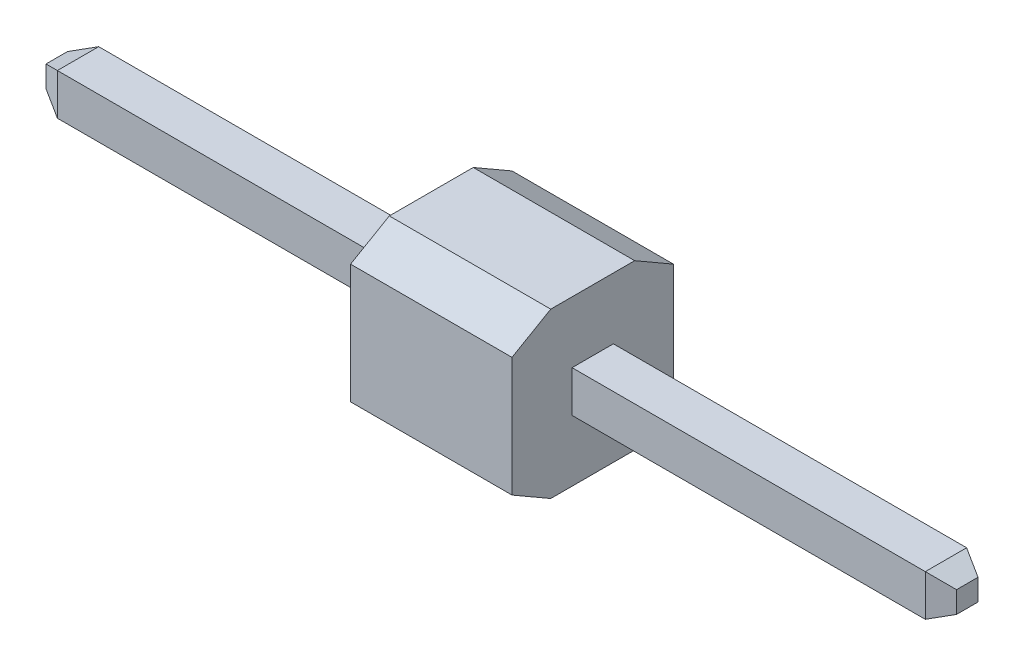
ISO-10303-21;
HEADER;
FILE_DESCRIPTION(('STEP AP214'),'2;1');
FILE_NAME('part.step','',(''),(''),'','','');
FILE_SCHEMA(('AUTOMOTIVE_DESIGN { 1 0 10303 214 1 1 1 1 }'));
ENDSEC;
DATA;
#1=APPLICATION_CONTEXT('core data for automotive mechanical design processes');
#2=APPLICATION_PROTOCOL_DEFINITION('international standard','automotive_design',2000,#1);
#3=PRODUCT_CONTEXT('',#1,'mechanical');
#4=PRODUCT('Part','Part','',(#3));
#5=PRODUCT_RELATED_PRODUCT_CATEGORY('part','',(#4));
#6=PRODUCT_DEFINITION_FORMATION('','',#4);
#7=PRODUCT_DEFINITION_CONTEXT('part definition',#1,'design');
#8=PRODUCT_DEFINITION('design','',#6,#7);
#9=PRODUCT_DEFINITION_SHAPE('','',#8);
#10=(LENGTH_UNIT() NAMED_UNIT(*) SI_UNIT(.MILLI.,.METRE.));
#11=(NAMED_UNIT(*) PLANE_ANGLE_UNIT() SI_UNIT($,.RADIAN.));
#12=(NAMED_UNIT(*) SI_UNIT($,.STERADIAN.) SOLID_ANGLE_UNIT());
#13=UNCERTAINTY_MEASURE_WITH_UNIT(LENGTH_MEASURE(1.E-05),#10,'distance_accuracy_value','');
#14=(GEOMETRIC_REPRESENTATION_CONTEXT(3) GLOBAL_UNCERTAINTY_ASSIGNED_CONTEXT((#13)) GLOBAL_UNIT_ASSIGNED_CONTEXT((#10,
#11,#12)) REPRESENTATION_CONTEXT('',''));
#15=CARTESIAN_POINT('',(0.,0.,0.));
#16=DIRECTION('',(0.,0.,1.));
#17=DIRECTION('',(1.,0.,0.));
#18=AXIS2_PLACEMENT_3D('',#15,#16,#17);
#19=CARTESIAN_POINT('',(5.42105211830969,13.017121448103,-2.62999936467802));
#20=DIRECTION('',(1.,-9.93476518829084E-08,4.37113882867379E-08));
#21=DIRECTION('',(-9.93476589883358E-08,-1.,8.74227765734759E-08));
#22=AXIS2_PLACEMENT_3D('',#19,#20,#21);
#23=PLANE('',#22);
#24=DIRECTION('',(-1.18186632779335E-08,-0.50000007571054,-0.866025360072934));
#25=VECTOR('',#24,1.);
#26=CARTESIAN_POINT('',(5.42105192613508,11.7735317468668,-1.05999925595995));
#27=LINE('',#26,#25);
#28=CARTESIAN_POINT('',(5.42105192613508,11.7735317468668,-1.05999925595995));
#29=VERTEX_POINT('',#28);
#30=CARTESIAN_POINT('',(5.42105191794687,11.4271215329031,-1.65999922567581));
#31=VERTEX_POINT('',#30);
#32=EDGE_CURVE('E11',#29,#31,#27,.T.);
#33=ORIENTED_EDGE('',*,*,#32,.T.);
#34=DIRECTION('',(4.37113811813104E-08,-8.74227842254741E-08,-0.999999999999995));
#35=VECTOR('',#34,1.);
#36=CARTESIAN_POINT('',(5.42105191794687,11.4271215329031,-1.65999922567581));
#37=LINE('',#36,#35);
#38=CARTESIAN_POINT('',(5.42105197477167,11.4271214192535,-2.95999922567581));
#39=VERTEX_POINT('',#38);
#40=EDGE_CURVE('E304',#31,#39,#37,.T.);
#41=ORIENTED_EDGE('',*,*,#40,.T.);
#42=DIRECTION('',(8.75289963531793E-08,0.499999924289839,-0.866025447495712));
#43=VECTOR('',#42,1.);
#44=CARTESIAN_POINT('',(5.42105197477167,11.4271214192535,-2.95999922567581));
#45=LINE('',#44,#43);
#46=CARTESIAN_POINT('',(5.42105203541353,11.7735315283098,-3.55999925595995));
#47=VERTEX_POINT('',#46);
#48=EDGE_CURVE('E296',#39,#47,#45,.T.);
#49=ORIENTED_EDGE('',*,*,#48,.T.);
#50=DIRECTION('',(9.93476588436478E-08,0.999999999999991,-8.74227764822788E-08));
#51=VECTOR('',#50,1.);
#52=CARTESIAN_POINT('',(5.42105203541353,11.7735315283098,-3.55999925595995));
#53=LINE('',#52,#51);
#54=CARTESIAN_POINT('',(5.42105221892651,13.6207112052799,-3.55999941744552));
#55=VERTEX_POINT('',#54);
#56=EDGE_CURVE('E281',#47,#55,#53,.T.);
#57=ORIENTED_EDGE('',*,*,#56,.T.);
#58=DIRECTION('',(-1.18186632778483E-08,-0.500000075710537,-0.866025360072935));
#59=VECTOR('',#58,1.);
#60=CARTESIAN_POINT('',(5.42105222711472,13.9671214192535,-2.95999944772966));
#61=LINE('',#60,#59);
#62=CARTESIAN_POINT('',(5.42105222711472,13.9671214192535,-2.95999944772966));
#63=VERTEX_POINT('',#62);
#64=EDGE_CURVE('E265',#63,#55,#61,.T.);
#65=ORIENTED_EDGE('',*,*,#64,.F.);
#66=DIRECTION('',(4.37113811813104E-08,-8.74227842254741E-08,-0.999999999999995));
#67=VECTOR('',#66,1.);
#68=CARTESIAN_POINT('',(5.42105217028992,13.9671215329031,-1.65999944772966));
#69=LINE('',#68,#67);
#70=CARTESIAN_POINT('',(5.42105217028992,13.9671215329031,-1.65999944772966));
#71=VERTEX_POINT('',#70);
#72=EDGE_CURVE('E248',#71,#63,#69,.T.);
#73=ORIENTED_EDGE('',*,*,#72,.F.);
#74=DIRECTION('',(8.75289963525477E-08,0.499999924289836,-0.866025447495714));
#75=VECTOR('',#74,1.);
#76=CARTESIAN_POINT('',(5.42105210964806,13.6207114238368,-1.05999941744552));
#77=LINE('',#76,#75);
#78=CARTESIAN_POINT('',(5.42105210964806,13.6207114238368,-1.05999941744552));
#79=VERTEX_POINT('',#78);
#80=EDGE_CURVE('E242',#79,#71,#77,.T.);
#81=ORIENTED_EDGE('',*,*,#80,.F.);
#82=DIRECTION('',(9.93476588436478E-08,0.999999999999991,-8.74227763620714E-08));
#83=VECTOR('',#82,1.);
#84=CARTESIAN_POINT('',(5.42105192613508,11.7735317468668,-1.05999925595995));
#85=LINE('',#84,#83);
#86=EDGE_CURVE('E236',#29,#79,#85,.T.);
#87=ORIENTED_EDGE('',*,*,#86,.F.);
#88=EDGE_LOOP('',(#33,#41,#49,#57,#65,#73,#81,#87));
#89=FACE_BOUND('',#88,.T.);
#90=DIRECTION('',(-4.37113803486431E-08,8.74227856773042E-08,0.999999999999995));
#91=VECTOR('',#90,1.);
#92=CARTESIAN_POINT('',(5.42105205472719,12.377121448103,-2.62999930872745));
#93=LINE('',#92,#91);
#94=CARTESIAN_POINT('',(5.42105205472719,12.377121448103,-2.62999930872745));
#95=VERTEX_POINT('',#94);
#96=CARTESIAN_POINT('',(5.4210520267519,12.3771215040536,-1.98999930872745));
#97=VERTEX_POINT('',#96);
#98=EDGE_CURVE('E302',#95,#97,#93,.T.);
#99=ORIENTED_EDGE('',*,*,#98,.T.);
#100=DIRECTION('',(-9.93476578781123E-08,-0.999999999999991,8.74227766567422E-08));
#101=VECTOR('',#100,1.);
#102=CARTESIAN_POINT('',(5.4210520903344,13.0171215040536,-1.98999936467802));
#103=LINE('',#102,#101);
#104=CARTESIAN_POINT('',(5.4210520903344,13.0171215040536,-1.98999936467802));
#105=VERTEX_POINT('',#104);
#106=EDGE_CURVE('E293',#105,#97,#103,.T.);
#107=ORIENTED_EDGE('',*,*,#106,.F.);
#108=DIRECTION('',(-4.37113817364219E-08,8.74227856773042E-08,0.999999999999995));
#109=VECTOR('',#108,1.);
#110=CARTESIAN_POINT('',(5.42105211830969,13.017121448103,-2.62999936467802));
#111=LINE('',#110,#109);
#112=CARTESIAN_POINT('',(5.42105211830969,13.017121448103,-2.62999936467802));
#113=VERTEX_POINT('',#112);
#114=EDGE_CURVE('E278',#113,#105,#111,.T.);
#115=ORIENTED_EDGE('',*,*,#114,.F.);
#116=DIRECTION('',(-9.93476592658911E-08,-0.999999999999991,8.74227766567422E-08));
#117=VECTOR('',#116,1.);
#118=CARTESIAN_POINT('',(5.42105211830969,13.017121448103,-2.62999936467802));
#119=LINE('',#118,#117);
#120=EDGE_CURVE('E263',#113,#95,#119,.T.);
#121=ORIENTED_EDGE('',*,*,#120,.T.);
#122=EDGE_LOOP('',(#99,#107,#115,#121));
#123=FACE_BOUND('',#122,.T.);
#124=ADVANCED_FACE('F17',(#89,#123),#23,.T.);
#125=CARTESIAN_POINT('',(2.92105211830969,13.0171216964722,-2.62999947395649));
#126=DIRECTION('',(1.,-9.93476518829084E-08,4.37113882867379E-08));
#127=DIRECTION('',(-9.93476589883358E-08,-1.,8.74227765734759E-08));
#128=AXIS2_PLACEMENT_3D('',#125,#126,#127);
#129=PLANE('',#128);
#130=DIRECTION('',(-1.1818662636946E-08,-0.50000007571054,-0.866025360072934));
#131=VECTOR('',#130,1.);
#132=CARTESIAN_POINT('',(2.92105192613508,11.7735319952359,-1.05999936523842));
#133=LINE('',#132,#131);
#134=CARTESIAN_POINT('',(2.92105192613508,11.7735319952359,-1.05999936523842));
#135=VERTEX_POINT('',#134);
#136=CARTESIAN_POINT('',(2.92105191794687,11.4271217812723,-1.65999933495428));
#137=VERTEX_POINT('',#136);
#138=EDGE_CURVE('E24',#135,#137,#133,.T.);
#139=ORIENTED_EDGE('',*,*,#138,.F.);
#140=DIRECTION('',(9.93476590840625E-08,0.999999999999991,-8.74227763620714E-08));
#141=VECTOR('',#140,1.);
#142=CARTESIAN_POINT('',(2.92105192613508,11.7735319952359,-1.05999936523842));
#143=LINE('',#142,#141);
#144=CARTESIAN_POINT('',(2.92105210964806,13.6207116722059,-1.05999952672399));
#145=VERTEX_POINT('',#144);
#146=EDGE_CURVE('E300',#135,#145,#143,.T.);
#147=ORIENTED_EDGE('',*,*,#146,.T.);
#148=DIRECTION('',(8.75289957115602E-08,0.499999924289836,-0.866025447495714));
#149=VECTOR('',#148,1.);
#150=CARTESIAN_POINT('',(2.92105210964806,13.6207116722059,-1.05999952672399));
#151=LINE('',#150,#149);
#152=CARTESIAN_POINT('',(2.92105217028992,13.9671217812723,-1.65999955700813));
#153=VERTEX_POINT('',#152);
#154=EDGE_CURVE('E286',#145,#153,#151,.T.);
#155=ORIENTED_EDGE('',*,*,#154,.T.);
#156=DIRECTION('',(4.37113811813104E-08,-8.74227842254741E-08,-0.999999999999995));
#157=VECTOR('',#156,1.);
#158=CARTESIAN_POINT('',(2.92105217028992,13.9671217812723,-1.65999955700813));
#159=LINE('',#158,#157);
#160=CARTESIAN_POINT('',(2.92105222711472,13.9671216676226,-2.95999955700813));
#161=VERTEX_POINT('',#160);
#162=EDGE_CURVE('E271',#153,#161,#159,.T.);
#163=ORIENTED_EDGE('',*,*,#162,.T.);
#164=DIRECTION('',(-1.18186626368607E-08,-0.500000075710537,-0.866025360072935));
#165=VECTOR('',#164,1.);
#166=CARTESIAN_POINT('',(2.92105222711472,13.9671216676226,-2.95999955700813));
#167=LINE('',#166,#165);
#168=CARTESIAN_POINT('',(2.92105221892651,13.620711453649,-3.55999952672399));
#169=VERTEX_POINT('',#168);
#170=EDGE_CURVE('E253',#161,#169,#167,.T.);
#171=ORIENTED_EDGE('',*,*,#170,.T.);
#172=DIRECTION('',(9.93476590840625E-08,0.999999999999991,-8.74227764822788E-08));
#173=VECTOR('',#172,1.);
#174=CARTESIAN_POINT('',(2.92105203541353,11.773531776679,-3.55999936523842));
#175=LINE('',#174,#173);
#176=CARTESIAN_POINT('',(2.92105203541353,11.773531776679,-3.55999936523842));
#177=VERTEX_POINT('',#176);
#178=EDGE_CURVE('E261',#177,#169,#175,.T.);
#179=ORIENTED_EDGE('',*,*,#178,.F.);
#180=DIRECTION('',(8.75289957121918E-08,0.499999924289839,-0.866025447495712));
#181=VECTOR('',#180,1.);
#182=CARTESIAN_POINT('',(2.92105197477167,11.4271216676226,-2.95999933495428));
#183=LINE('',#182,#181);
#184=CARTESIAN_POINT('',(2.92105197477167,11.4271216676226,-2.95999933495428));
#185=VERTEX_POINT('',#184);
#186=EDGE_CURVE('E276',#185,#177,#183,.T.);
#187=ORIENTED_EDGE('',*,*,#186,.F.);
#188=DIRECTION('',(4.37113811813104E-08,-8.74227842254741E-08,-0.999999999999995));
#189=VECTOR('',#188,1.);
#190=CARTESIAN_POINT('',(2.92105191794687,11.4271217812723,-1.65999933495428));
#191=LINE('',#190,#189);
#192=EDGE_CURVE('E291',#137,#185,#191,.T.);
#193=ORIENTED_EDGE('',*,*,#192,.F.);
#194=EDGE_LOOP('',(#139,#147,#155,#163,#171,#179,#187,#193));
#195=FACE_BOUND('',#194,.T.);
#196=DIRECTION('',(-9.93476592658911E-08,-0.999999999999991,8.74227766567422E-08));
#197=VECTOR('',#196,1.);
#198=CARTESIAN_POINT('',(2.9210520903344,13.0171217524228,-1.98999947395649));
#199=LINE('',#198,#197);
#200=CARTESIAN_POINT('',(2.9210520903344,13.0171217524228,-1.98999947395649));
#201=VERTEX_POINT('',#200);
#202=CARTESIAN_POINT('',(2.9210520267519,12.3771217524228,-1.98999941800592));
#203=VERTEX_POINT('',#202);
#204=EDGE_CURVE('E298',#201,#203,#199,.T.);
#205=ORIENTED_EDGE('',*,*,#204,.T.);
#206=DIRECTION('',(-4.37113810425325E-08,8.74227856773042E-08,0.999999999999995));
#207=VECTOR('',#206,1.);
#208=CARTESIAN_POINT('',(2.92105205472719,12.3771216964722,-2.62999941800592));
#209=LINE('',#208,#207);
#210=CARTESIAN_POINT('',(2.92105205472719,12.3771216964722,-2.62999941800592));
#211=VERTEX_POINT('',#210);
#212=EDGE_CURVE('E283',#211,#203,#209,.T.);
#213=ORIENTED_EDGE('',*,*,#212,.F.);
#214=DIRECTION('',(-9.93476592658911E-08,-0.999999999999991,8.74227766567422E-08));
#215=VECTOR('',#214,1.);
#216=CARTESIAN_POINT('',(2.92105211830969,13.0171216964722,-2.62999947395649));
#217=LINE('',#216,#215);
#218=CARTESIAN_POINT('',(2.92105211830969,13.0171216964722,-2.62999947395649));
#219=VERTEX_POINT('',#218);
#220=EDGE_CURVE('E268',#219,#211,#217,.T.);
#221=ORIENTED_EDGE('',*,*,#220,.F.);
#222=DIRECTION('',(-4.37113810425325E-08,8.74227856773042E-08,0.999999999999995));
#223=VECTOR('',#222,1.);
#224=CARTESIAN_POINT('',(2.92105211830969,13.0171216964722,-2.62999947395649));
#225=LINE('',#224,#223);
#226=EDGE_CURVE('E251',#219,#201,#225,.T.);
#227=ORIENTED_EDGE('',*,*,#226,.T.);
#228=EDGE_LOOP('',(#205,#213,#221,#227));
#229=FACE_BOUND('',#228,.T.);
#230=ADVANCED_FACE('F314',(#195,#229),#129,.F.);
#231=CARTESIAN_POINT('',(5.42105192613508,11.7735317468668,-1.05999925595995));
#232=DIRECTION('',(1.07893287081065E-07,0.866025360072937,-0.500000075710535));
#233=DIRECTION('',(1.18186629566715E-08,0.500000075710542,0.866025360072941));
#234=AXIS2_PLACEMENT_3D('',#231,#232,#233);
#235=PLANE('',#234);
#236=ORIENTED_EDGE('',*,*,#138,.T.);
#237=DIRECTION('',(-0.999999999999994,9.93476533039933E-08,-4.37113883755555E-08));
#238=VECTOR('',#237,1.);
#239=CARTESIAN_POINT('',(5.42105191794687,11.4271215329031,-1.65999922567581));
#240=LINE('',#239,#238);
#241=EDGE_CURVE('E288',#31,#137,#240,.T.);
#242=ORIENTED_EDGE('',*,*,#241,.F.);
#243=ORIENTED_EDGE('',*,*,#32,.F.);
#244=DIRECTION('',(-0.999999999999994,9.93476504618223E-08,-4.3711388109102E-08));
#245=VECTOR('',#244,1.);
#246=CARTESIAN_POINT('',(5.42105192613508,11.7735317468668,-1.05999925595995));
#247=LINE('',#246,#245);
#248=EDGE_CURVE('E256',#29,#135,#247,.T.);
#249=ORIENTED_EDGE('',*,*,#248,.T.);
#250=EDGE_LOOP('',(#236,#242,#243,#249));
#251=FACE_BOUND('',#250,.T.);
#252=ADVANCED_FACE('F306',(#251),#235,.F.);
#253=CARTESIAN_POINT('',(5.42105191794687,11.4271215329031,-1.65999922567581));
#254=DIRECTION('',(9.93476589883358E-08,1.,-8.74227765734759E-08));
#255=DIRECTION('',(1.,-9.93476518829084E-08,4.37113882867379E-08));
#256=AXIS2_PLACEMENT_3D('',#253,#254,#255);
#257=PLANE('',#256);
#258=ORIENTED_EDGE('',*,*,#192,.T.);
#259=DIRECTION('',(-0.999999999999994,9.93476533039933E-08,-4.37113884643734E-08));
#260=VECTOR('',#259,1.);
#261=CARTESIAN_POINT('',(5.42105197477167,11.4271214192535,-2.95999922567581));
#262=LINE('',#261,#260);
#263=EDGE_CURVE('E273',#39,#185,#262,.T.);
#264=ORIENTED_EDGE('',*,*,#263,.F.);
#265=ORIENTED_EDGE('',*,*,#40,.F.);
#266=ORIENTED_EDGE('',*,*,#241,.T.);
#267=EDGE_LOOP('',(#258,#264,#265,#266));
#268=FACE_BOUND('',#267,.T.);
#269=ADVANCED_FACE('F311',(#268),#257,.F.);
#270=CARTESIAN_POINT('',(5.42105197477167,11.4271214192535,-2.95999922567581));
#271=DIRECTION('',(6.41819058997377E-08,0.866025447495721,0.499999924289845));
#272=DIRECTION('',(-8.7528996031702E-08,-0.499999924289838,0.866025447495717));
#273=AXIS2_PLACEMENT_3D('',#270,#271,#272);
#274=PLANE('',#273);
#275=ORIENTED_EDGE('',*,*,#186,.T.);
#276=DIRECTION('',(-0.999999999999994,9.93476504618223E-08,-4.37113882867377E-08));
#277=VECTOR('',#276,1.);
#278=CARTESIAN_POINT('',(5.42105203541353,11.7735315283098,-3.55999925595995));
#279=LINE('',#278,#277);
#280=EDGE_CURVE('E258',#47,#177,#279,.T.);
#281=ORIENTED_EDGE('',*,*,#280,.F.);
#282=ORIENTED_EDGE('',*,*,#48,.F.);
#283=ORIENTED_EDGE('',*,*,#263,.T.);
#284=EDGE_LOOP('',(#275,#281,#282,#283));
#285=FACE_BOUND('',#284,.T.);
#286=ADVANCED_FACE('F319',(#285),#274,.F.);
#287=CARTESIAN_POINT('',(5.42105203541353,11.7735315283098,-3.55999925595995));
#288=DIRECTION('',(-4.37113811813106E-08,8.74227836789032E-08,1.));
#289=DIRECTION('',(-1.,9.93476518829084E-08,-4.37113882867379E-08));
#290=AXIS2_PLACEMENT_3D('',#287,#288,#289);
#291=PLANE('',#290);
#292=ORIENTED_EDGE('',*,*,#178,.T.);
#293=DIRECTION('',(-0.999999999999994,9.93476533039933E-08,-4.37113884643734E-08));
#294=VECTOR('',#293,1.);
#295=CARTESIAN_POINT('',(5.42105221892651,13.6207112052799,-3.55999941744552));
#296=LINE('',#295,#294);
#297=EDGE_CURVE('E245',#55,#169,#296,.T.);
#298=ORIENTED_EDGE('',*,*,#297,.F.);
#299=ORIENTED_EDGE('',*,*,#56,.F.);
#300=ORIENTED_EDGE('',*,*,#280,.T.);
#301=EDGE_LOOP('',(#292,#298,#299,#300));
#302=FACE_BOUND('',#301,.T.);
#303=ADVANCED_FACE('F326',(#302),#291,.F.);
#304=CARTESIAN_POINT('',(5.42105222711472,13.9671214192535,-2.95999944772966));
#305=DIRECTION('',(1.07893287081065E-07,0.866025360072937,-0.500000075710535));
#306=DIRECTION('',(1.18186629566715E-08,0.500000075710542,0.866025360072941));
#307=AXIS2_PLACEMENT_3D('',#304,#305,#306);
#308=PLANE('',#307);
#309=ORIENTED_EDGE('',*,*,#170,.F.);
#310=DIRECTION('',(-0.999999999999994,9.93476490407369E-08,-4.37113882867377E-08));
#311=VECTOR('',#310,1.);
#312=CARTESIAN_POINT('',(5.42105222711472,13.9671214192535,-2.95999944772966));
#313=LINE('',#312,#311);
#314=EDGE_CURVE('E239',#63,#161,#313,.T.);
#315=ORIENTED_EDGE('',*,*,#314,.F.);
#316=ORIENTED_EDGE('',*,*,#64,.T.);
#317=ORIENTED_EDGE('',*,*,#297,.T.);
#318=EDGE_LOOP('',(#309,#315,#316,#317));
#319=FACE_BOUND('',#318,.T.);
#320=ADVANCED_FACE('F329',(#319),#308,.T.);
#321=CARTESIAN_POINT('',(5.42105217028992,13.9671215329031,-1.65999944772966));
#322=DIRECTION('',(9.93476589883358E-08,1.,-8.74227765734759E-08));
#323=DIRECTION('',(1.,-9.93476518829084E-08,4.37113882867379E-08));
#324=AXIS2_PLACEMENT_3D('',#321,#322,#323);
#325=PLANE('',#324);
#326=ORIENTED_EDGE('',*,*,#162,.F.);
#327=DIRECTION('',(-0.999999999999994,9.93476490407369E-08,-4.37113882867377E-08));
#328=VECTOR('',#327,1.);
#329=CARTESIAN_POINT('',(5.42105217028992,13.9671215329031,-1.65999944772966));
#330=LINE('',#329,#328);
#331=EDGE_CURVE('E233',#71,#153,#330,.T.);
#332=ORIENTED_EDGE('',*,*,#331,.F.);
#333=ORIENTED_EDGE('',*,*,#72,.T.);
#334=ORIENTED_EDGE('',*,*,#314,.T.);
#335=EDGE_LOOP('',(#326,#332,#333,#334));
#336=FACE_BOUND('',#335,.T.);
#337=ADVANCED_FACE('F333',(#336),#325,.T.);
#338=CARTESIAN_POINT('',(5.42105210964806,13.6207114238368,-1.05999941744552));
#339=DIRECTION('',(6.41819058997377E-08,0.866025447495721,0.499999924289845));
#340=DIRECTION('',(-8.7528996031702E-08,-0.499999924289838,0.866025447495717));
#341=AXIS2_PLACEMENT_3D('',#338,#339,#340);
#342=PLANE('',#341);
#343=ORIENTED_EDGE('',*,*,#154,.F.);
#344=DIRECTION('',(-0.999999999999994,9.93476533039933E-08,-4.3711388109102E-08));
#345=VECTOR('',#344,1.);
#346=CARTESIAN_POINT('',(5.42105210964806,13.6207114238368,-1.05999941744552));
#347=LINE('',#346,#345);
#348=EDGE_CURVE('E230',#79,#145,#347,.T.);
#349=ORIENTED_EDGE('',*,*,#348,.F.);
#350=ORIENTED_EDGE('',*,*,#80,.T.);
#351=ORIENTED_EDGE('',*,*,#331,.T.);
#352=EDGE_LOOP('',(#343,#349,#350,#351));
#353=FACE_BOUND('',#352,.T.);
#354=ADVANCED_FACE('F337',(#353),#342,.T.);
#355=CARTESIAN_POINT('',(5.42105192613508,11.7735317468668,-1.05999925595995));
#356=DIRECTION('',(-4.37113811813106E-08,8.74227835615132E-08,1.));
#357=DIRECTION('',(-9.93476589883358E-08,-1.,8.74227764560859E-08));
#358=AXIS2_PLACEMENT_3D('',#355,#356,#357);
#359=PLANE('',#358);
#360=ORIENTED_EDGE('',*,*,#146,.F.);
#361=ORIENTED_EDGE('',*,*,#248,.F.);
#362=ORIENTED_EDGE('',*,*,#86,.T.);
#363=ORIENTED_EDGE('',*,*,#348,.T.);
#364=EDGE_LOOP('',(#360,#361,#362,#363));
#365=FACE_BOUND('',#364,.T.);
#366=ADVANCED_FACE('F339',(#365),#359,.T.);
#367=CARTESIAN_POINT('',(-2.87894788169031,13.0171222726885,-2.62999972748255));
#368=DIRECTION('',(-1.,9.93476518829084E-08,-4.37113882867379E-08));
#369=DIRECTION('',(9.93476589883358E-08,1.,-8.74227765734759E-08));
#370=AXIS2_PLACEMENT_3D('',#367,#368,#369);
#371=PLANE('',#370);
#372=DIRECTION('',(9.93476608211201E-08,0.999999999999991,-8.7422776141512E-08));
#373=VECTOR('',#372,1.);
#374=CARTESIAN_POINT('',(-2.87894795123395,12.5310038423764,-2.14388121217572));
#375=LINE('',#374,#373);
#376=CARTESIAN_POINT('',(-2.87894795123395,12.5310038423764,-2.14388121217572));
#377=VERTEX_POINT('',#376);
#378=CARTESIAN_POINT('',(-2.87894791822699,12.8632407879864,-2.1438812412208));
#379=VERTEX_POINT('',#378);
#380=EDGE_CURVE('E228',#377,#379,#375,.T.);
#381=ORIENTED_EDGE('',*,*,#380,.T.);
#382=DIRECTION('',(4.37113820547149E-08,-8.74227748027428E-08,-0.999999999999995));
#383=VECTOR('',#382,1.);
#384=CARTESIAN_POINT('',(-2.87894791822699,12.8632407879864,-2.1438812412208));
#385=LINE('',#384,#383);
#386=CARTESIAN_POINT('',(-2.87894790370445,12.8632407589413,-2.4761181868388));
#387=VERTEX_POINT('',#386);
#388=EDGE_CURVE('E223',#379,#387,#385,.T.);
#389=ORIENTED_EDGE('',*,*,#388,.T.);
#390=DIRECTION('',(-9.93476581477919E-08,-0.999999999999991,8.74227774781761E-08));
#391=VECTOR('',#390,1.);
#392=CARTESIAN_POINT('',(-2.87894790370446,12.8632407589413,-2.4761181868388));
#393=LINE('',#392,#391);
#394=CARTESIAN_POINT('',(-2.87894793671142,12.5310038133313,-2.47611815779372));
#395=VERTEX_POINT('',#394);
#396=EDGE_CURVE('E215',#387,#395,#393,.T.);
#397=ORIENTED_EDGE('',*,*,#396,.T.);
#398=DIRECTION('',(-4.37113740347301E-08,8.7422774802743E-08,0.999999999999995));
#399=VECTOR('',#398,1.);
#400=CARTESIAN_POINT('',(-2.87894793671142,12.5310038133313,-2.47611815779372));
#401=LINE('',#400,#399);
#402=EDGE_CURVE('E207',#395,#377,#401,.T.);
#403=ORIENTED_EDGE('',*,*,#402,.T.);
#404=EDGE_LOOP('',(#381,#389,#397,#403));
#405=FACE_BOUND('',#404,.T.);
#406=ADVANCED_FACE('F341',(#405),#371,.T.);
#407=CARTESIAN_POINT('',(-2.87894788169031,13.0171222726885,-2.62999972748255));
#408=DIRECTION('',(9.93476589883358E-08,1.,-8.74227764510112E-08));
#409=DIRECTION('',(-4.37113811813106E-08,8.74227835564385E-08,1.));
#410=AXIS2_PLACEMENT_3D('',#407,#408,#409);
#411=PLANE('',#410);
#412=DIRECTION('',(0.999999999999994,-9.93476508047534E-08,4.37113882769953E-08));
#413=VECTOR('',#412,1.);
#414=CARTESIAN_POINT('',(-2.54894788169031,13.0171222399038,-2.62999971305779));
#415=LINE('',#414,#413);
#416=CARTESIAN_POINT('',(-2.54894788169031,13.0171222399038,-2.62999971305779));
#417=VERTEX_POINT('',#416);
#418=EDGE_CURVE('E225',#417,#219,#415,.T.);
#419=ORIENTED_EDGE('',*,*,#418,.F.);
#420=DIRECTION('',(-4.37113817364219E-08,8.74227856773042E-08,0.999999999999995));
#421=VECTOR('',#420,1.);
#422=CARTESIAN_POINT('',(-2.54894788169031,13.0171222399038,-2.62999971305779));
#423=LINE('',#422,#421);
#424=CARTESIAN_POINT('',(-2.5489479096656,13.0171222958544,-1.98999971305779));
#425=VERTEX_POINT('',#424);
#426=EDGE_CURVE('E217',#417,#425,#423,.T.);
#427=ORIENTED_EDGE('',*,*,#426,.T.);
#428=DIRECTION('',(0.999999999999994,-9.93476508047534E-08,4.3711388195809E-08));
#429=VECTOR('',#428,1.);
#430=CARTESIAN_POINT('',(-2.5489479096656,13.0171222958544,-1.98999971305779));
#431=LINE('',#430,#429);
#432=EDGE_CURVE('E220',#425,#201,#431,.T.);
#433=ORIENTED_EDGE('',*,*,#432,.T.);
#434=ORIENTED_EDGE('',*,*,#226,.F.);
#435=EDGE_LOOP('',(#419,#427,#433,#434));
#436=FACE_BOUND('',#435,.T.);
#437=ADVANCED_FACE('F348',(#436),#411,.T.);
#438=CARTESIAN_POINT('',(-2.8789479096656,13.0171223286391,-1.98999972748255));
#439=DIRECTION('',(-4.37113811813106E-08,8.74227836789032E-08,1.));
#440=DIRECTION('',(-1.,9.93476518829084E-08,-4.37113882867379E-08));
#441=AXIS2_PLACEMENT_3D('',#438,#439,#440);
#442=PLANE('',#441);
#443=ORIENTED_EDGE('',*,*,#432,.F.);
#444=DIRECTION('',(-9.93476578781123E-08,-0.999999999999991,8.74227766567422E-08));
#445=VECTOR('',#444,1.);
#446=CARTESIAN_POINT('',(-2.5489479096656,13.0171222958544,-1.98999971305779));
#447=LINE('',#446,#445);
#448=CARTESIAN_POINT('',(-2.5489479732481,12.3771222958544,-1.98999965710721));
#449=VERTEX_POINT('',#448);
#450=EDGE_CURVE('E209',#425,#449,#447,.T.);
#451=ORIENTED_EDGE('',*,*,#450,.T.);
#452=DIRECTION('',(0.999999999999994,-9.93476508047534E-08,4.3711388195809E-08));
#453=VECTOR('',#452,1.);
#454=CARTESIAN_POINT('',(-2.5489479732481,12.3771222958544,-1.98999965710721));
#455=LINE('',#454,#453);
#456=EDGE_CURVE('E212',#449,#203,#455,.T.);
#457=ORIENTED_EDGE('',*,*,#456,.T.);
#458=ORIENTED_EDGE('',*,*,#204,.F.);
#459=EDGE_LOOP('',(#443,#451,#457,#458));
#460=FACE_BOUND('',#459,.T.);
#461=ADVANCED_FACE('F424',(#460),#442,.T.);
#462=CARTESIAN_POINT('',(-2.87894794527281,12.3771222726885,-2.62999967153197));
#463=DIRECTION('',(9.93476589883357E-08,1.,-8.74227764040693E-08));
#464=DIRECTION('',(-4.37113811813106E-08,8.74227835094966E-08,1.));
#465=AXIS2_PLACEMENT_3D('',#462,#463,#464);
#466=PLANE('',#465);
#467=ORIENTED_EDGE('',*,*,#456,.F.);
#468=DIRECTION('',(4.37113817364219E-08,-8.74227912284193E-08,-0.999999999999995));
#469=VECTOR('',#468,1.);
#470=CARTESIAN_POINT('',(-2.5489479732481,12.3771222958544,-1.98999965710721));
#471=LINE('',#470,#469);
#472=CARTESIAN_POINT('',(-2.54894794527281,12.3771222399038,-2.62999965710721));
#473=VERTEX_POINT('',#472);
#474=EDGE_CURVE('E201',#449,#473,#471,.T.);
#475=ORIENTED_EDGE('',*,*,#474,.T.);
#476=DIRECTION('',(0.999999999999994,-9.93476508047534E-08,4.37113882769953E-08));
#477=VECTOR('',#476,1.);
#478=CARTESIAN_POINT('',(-2.54894794527281,12.3771222399038,-2.62999965710721));
#479=LINE('',#478,#477);
#480=EDGE_CURVE('E204',#473,#211,#479,.T.);
#481=ORIENTED_EDGE('',*,*,#480,.T.);
#482=ORIENTED_EDGE('',*,*,#212,.T.);
#483=EDGE_LOOP('',(#467,#475,#481,#482));
#484=FACE_BOUND('',#483,.T.);
#485=ADVANCED_FACE('F421',(#484),#466,.F.);
#486=CARTESIAN_POINT('',(-2.87894788169031,13.0171222726885,-2.62999972748255));
#487=DIRECTION('',(-4.37113811813106E-08,8.74227836789032E-08,1.));
#488=DIRECTION('',(-1.,9.93476518829084E-08,-4.37113882867379E-08));
#489=AXIS2_PLACEMENT_3D('',#486,#487,#488);
#490=PLANE('',#489);
#491=ORIENTED_EDGE('',*,*,#480,.F.);
#492=DIRECTION('',(9.93476578781123E-08,0.999999999999991,-8.74227766567422E-08));
#493=VECTOR('',#492,1.);
#494=CARTESIAN_POINT('',(-2.54894794527281,12.3771222399038,-2.62999965710721));
#495=LINE('',#494,#493);
#496=EDGE_CURVE('E196',#473,#417,#495,.T.);
#497=ORIENTED_EDGE('',*,*,#496,.T.);
#498=ORIENTED_EDGE('',*,*,#418,.T.);
#499=ORIENTED_EDGE('',*,*,#220,.T.);
#500=EDGE_LOOP('',(#491,#497,#498,#499));
#501=FACE_BOUND('',#500,.T.);
#502=ADVANCED_FACE('F376',(#501),#490,.F.);
#503=CARTESIAN_POINT('',(-2.87894788169031,13.0171222726885,-2.62999972748255));
#504=DIRECTION('',(-4.37113811813106E-08,8.74227836789032E-08,1.));
#505=DIRECTION('',(-1.,9.93476518829084E-08,-4.37113882867379E-08));
#506=AXIS2_PLACEMENT_3D('',#503,#504,#505);
#507=PLANE('',#506);
#508=DIRECTION('',(0.999999999999994,-9.93476417118848E-08,4.37113882769953E-08));
#509=VECTOR('',#508,1.);
#510=CARTESIAN_POINT('',(5.42105211830969,13.017121448103,-2.62999936467802));
#511=LINE('',#510,#509);
#512=CARTESIAN_POINT('',(10.8910521183097,13.0171209046714,-2.62999912557673));
#513=VERTEX_POINT('',#512);
#514=EDGE_CURVE('E199',#113,#513,#511,.T.);
#515=ORIENTED_EDGE('',*,*,#514,.T.);
#516=DIRECTION('',(-9.93476578781123E-08,-0.999999999999991,8.74227766567422E-08));
#517=VECTOR('',#516,1.);
#518=CARTESIAN_POINT('',(10.8910521183097,13.0171209046714,-2.62999912557673));
#519=LINE('',#518,#517);
#520=CARTESIAN_POINT('',(10.8910520547272,12.3771209046714,-2.62999906962615));
#521=VERTEX_POINT('',#520);
#522=EDGE_CURVE('E191',#513,#521,#519,.T.);
#523=ORIENTED_EDGE('',*,*,#522,.T.);
#524=DIRECTION('',(0.999999999999994,-9.93476572996596E-08,4.37113882769953E-08));
#525=VECTOR('',#524,1.);
#526=CARTESIAN_POINT('',(5.42105205472719,12.3771214481031,-2.62999930872745));
#527=LINE('',#526,#525);
#528=EDGE_CURVE('E194',#95,#521,#527,.T.);
#529=ORIENTED_EDGE('',*,*,#528,.F.);
#530=ORIENTED_EDGE('',*,*,#120,.F.);
#531=EDGE_LOOP('',(#515,#523,#529,#530));
#532=FACE_BOUND('',#531,.T.);
#533=ADVANCED_FACE('F367',(#532),#507,.F.);
#534=CARTESIAN_POINT('',(-2.87894794527281,12.3771222726885,-2.62999967153197));
#535=DIRECTION('',(9.93476589883357E-08,1.,-8.74227764040693E-08));
#536=DIRECTION('',(-4.37113811813106E-08,8.74227835094966E-08,1.));
#537=AXIS2_PLACEMENT_3D('',#534,#535,#536);
#538=PLANE('',#537);
#539=ORIENTED_EDGE('',*,*,#528,.T.);
#540=DIRECTION('',(-4.37113817364219E-08,8.74227856773042E-08,0.999999999999995));
#541=VECTOR('',#540,1.);
#542=CARTESIAN_POINT('',(10.8910520547272,12.3771209046714,-2.62999906962615));
#543=LINE('',#542,#541);
#544=CARTESIAN_POINT('',(10.8910520267519,12.377120960622,-1.98999906962615));
#545=VERTEX_POINT('',#544);
#546=EDGE_CURVE('E186',#521,#545,#543,.T.);
#547=ORIENTED_EDGE('',*,*,#546,.T.);
#548=DIRECTION('',(0.999999999999994,-9.93476572996596E-08,4.37113881146227E-08));
#549=VECTOR('',#548,1.);
#550=CARTESIAN_POINT('',(5.4210520267519,12.3771215040536,-1.98999930872745));
#551=LINE('',#550,#549);
#552=EDGE_CURVE('E189',#97,#545,#551,.T.);
#553=ORIENTED_EDGE('',*,*,#552,.F.);
#554=ORIENTED_EDGE('',*,*,#98,.F.);
#555=EDGE_LOOP('',(#539,#547,#553,#554));
#556=FACE_BOUND('',#555,.T.);
#557=ADVANCED_FACE('F364',(#556),#538,.F.);
#558=CARTESIAN_POINT('',(-2.8789479096656,13.0171223286391,-1.98999972748255));
#559=DIRECTION('',(-4.37113811813106E-08,8.74227836789032E-08,1.));
#560=DIRECTION('',(-1.,9.93476518829084E-08,-4.37113882867379E-08));
#561=AXIS2_PLACEMENT_3D('',#558,#559,#560);
#562=PLANE('',#561);
#563=ORIENTED_EDGE('',*,*,#552,.T.);
#564=DIRECTION('',(9.93476606536699E-08,0.999999999999991,-8.74227766567422E-08));
#565=VECTOR('',#564,1.);
#566=CARTESIAN_POINT('',(10.8910520267519,12.377120960622,-1.98999906962615));
#567=LINE('',#566,#565);
#568=CARTESIAN_POINT('',(10.8910520903344,13.017120960622,-1.98999912557673));
#569=VERTEX_POINT('',#568);
#570=EDGE_CURVE('E176',#545,#569,#567,.T.);
#571=ORIENTED_EDGE('',*,*,#570,.T.);
#572=DIRECTION('',(0.999999999999994,-9.93476417118848E-08,4.37113881146227E-08));
#573=VECTOR('',#572,1.);
#574=CARTESIAN_POINT('',(5.4210520903344,13.0171215040536,-1.98999936467802));
#575=LINE('',#574,#573);
#576=EDGE_CURVE('E179',#105,#569,#575,.T.);
#577=ORIENTED_EDGE('',*,*,#576,.F.);
#578=ORIENTED_EDGE('',*,*,#106,.T.);
#579=EDGE_LOOP('',(#563,#571,#577,#578));
#580=FACE_BOUND('',#579,.T.);
#581=ADVANCED_FACE('F366',(#580),#562,.T.);
#582=CARTESIAN_POINT('',(-2.87894788169031,13.0171222726885,-2.62999972748255));
#583=DIRECTION('',(9.93476589883358E-08,1.,-8.74227764510112E-08));
#584=DIRECTION('',(-4.37113811813106E-08,8.74227835564385E-08,1.));
#585=AXIS2_PLACEMENT_3D('',#582,#583,#584);
#586=PLANE('',#585);
#587=ORIENTED_EDGE('',*,*,#576,.T.);
#588=DIRECTION('',(4.37113789608643E-08,-8.74227856773042E-08,-0.999999999999995));
#589=VECTOR('',#588,1.);
#590=CARTESIAN_POINT('',(10.8910520903344,13.017120960622,-1.98999912557673));
#591=LINE('',#590,#589);
#592=EDGE_CURVE('E167',#569,#513,#591,.T.);
#593=ORIENTED_EDGE('',*,*,#592,.T.);
#594=ORIENTED_EDGE('',*,*,#514,.F.);
#595=ORIENTED_EDGE('',*,*,#114,.T.);
#596=EDGE_LOOP('',(#587,#593,#594,#595));
#597=FACE_BOUND('',#596,.T.);
#598=ADVANCED_FACE('F373',(#597),#586,.T.);
#599=CARTESIAN_POINT('',(11.2210521183097,13.0171208718867,-2.62999911115197));
#600=DIRECTION('',(-1.,9.93476518829084E-08,-4.37113882867379E-08));
#601=DIRECTION('',(9.93476589883358E-08,1.,-8.74227765734759E-08));
#602=AXIS2_PLACEMENT_3D('',#599,#600,#601);
#603=PLANE('',#602);
#604=DIRECTION('',(-9.93476581477919E-08,-0.999999999999991,8.74227774781761E-08));
#605=VECTOR('',#604,1.);
#606=CARTESIAN_POINT('',(11.221052081773,12.8632393871845,-2.14388062489022));
#607=LINE('',#606,#605);
#608=CARTESIAN_POINT('',(11.221052081773,12.8632393871845,-2.14388062489022));
#609=VERTEX_POINT('',#608);
#610=CARTESIAN_POINT('',(11.221052048766,12.5310024415745,-2.14388059584514));
#611=VERTEX_POINT('',#610);
#612=EDGE_CURVE('E153',#609,#611,#607,.T.);
#613=ORIENTED_EDGE('',*,*,#612,.T.);
#614=DIRECTION('',(4.37113820547149E-08,-8.74228068826821E-08,-0.999999999999995));
#615=VECTOR('',#614,1.);
#616=CARTESIAN_POINT('',(11.221052048766,12.5310024415745,-2.14388059584514));
#617=LINE('',#616,#615);
#618=CARTESIAN_POINT('',(11.2210520632886,12.5310024125294,-2.47611754146314));
#619=VERTEX_POINT('',#618);
#620=EDGE_CURVE('E395',#611,#619,#617,.T.);
#621=ORIENTED_EDGE('',*,*,#620,.T.);
#622=DIRECTION('',(9.93476581477919E-08,0.999999999999991,-8.7422776141512E-08));
#623=VECTOR('',#622,1.);
#624=CARTESIAN_POINT('',(11.2210520632886,12.5310024125294,-2.47611754146314));
#625=LINE('',#624,#623);
#626=CARTESIAN_POINT('',(11.2210520962955,12.8632393581394,-2.47611757050822));
#627=VERTEX_POINT('',#626);
#628=EDGE_CURVE('E156',#619,#627,#625,.T.);
#629=ORIENTED_EDGE('',*,*,#628,.T.);
#630=DIRECTION('',(-4.37113874013715E-08,8.7422774802743E-08,0.999999999999995));
#631=VECTOR('',#630,1.);
#632=CARTESIAN_POINT('',(11.2210520962955,12.8632393581394,-2.47611757050822));
#633=LINE('',#632,#631);
#634=EDGE_CURVE('E149',#627,#609,#633,.T.);
#635=ORIENTED_EDGE('',*,*,#634,.T.);
#636=EDGE_LOOP('',(#613,#621,#629,#635));
#637=FACE_BOUND('',#636,.T.);
#638=ADVANCED_FACE('F151',(#637),#603,.F.);
#639=CARTESIAN_POINT('',(-2.87894792998504,12.5310037998785,-2.62999968498472));
#640=DIRECTION('',(-0.422618351780369,-0.906307745050466,6.07587120833484E-08));
#641=DIRECTION('',(4.37113811813106E-08,-8.74227835094966E-08,-1.));
#642=AXIS2_PLACEMENT_3D('',#639,#640,#641);
#643=PLANE('',#642);
#644=DIRECTION('',(0.834817073788752,-0.389281669540033,0.389281691158098));
#645=VECTOR('',#644,1.);
#646=CARTESIAN_POINT('',(-2.87894795123397,12.5310038423759,-2.1438812121762));
#647=LINE('',#646,#645);
#648=EDGE_CURVE('E181',#377,#449,#647,.T.);
#649=ORIENTED_EDGE('',*,*,#648,.F.);
#650=ORIENTED_EDGE('',*,*,#402,.F.);
#651=DIRECTION('',(-0.834817107820822,0.389281737604206,0.389281550111904));
#652=VECTOR('',#651,1.);
#653=CARTESIAN_POINT('',(-2.54894794527324,12.3771222399024,-2.62999965710667));
#654=LINE('',#653,#652);
#655=EDGE_CURVE('E404',#473,#395,#654,.T.);
#656=ORIENTED_EDGE('',*,*,#655,.F.);
#657=ORIENTED_EDGE('',*,*,#474,.F.);
#658=EDGE_LOOP('',(#649,#650,#656,#657));
#659=FACE_BOUND('',#658,.T.);
#660=ADVANCED_FACE('F418',(#659),#643,.T.);
#661=CARTESIAN_POINT('',(-2.87894788841669,13.0171222861413,-2.47611820029155));
#662=DIRECTION('',(-0.422618222124847,-3.72458176658199E-08,-0.906307805509828));
#663=DIRECTION('',(9.93476589883358E-08,1.,-8.74227765734759E-08));
#664=AXIS2_PLACEMENT_3D('',#661,#662,#663);
#665=PLANE('',#664);
#666=ORIENTED_EDGE('',*,*,#655,.T.);
#667=ORIENTED_EDGE('',*,*,#396,.F.);
#668=DIRECTION('',(-0.834817185169259,-0.389281503665788,0.389281618176067));
#669=VECTOR('',#668,1.);
#670=CARTESIAN_POINT('',(-2.54894788168917,13.0171222399011,-2.62999971305806));
#671=LINE('',#670,#669);
#672=EDGE_CURVE('E160',#417,#387,#671,.T.);
#673=ORIENTED_EDGE('',*,*,#672,.F.);
#674=ORIENTED_EDGE('',*,*,#496,.F.);
#675=EDGE_LOOP('',(#666,#667,#673,#674));
#676=FACE_BOUND('',#675,.T.);
#677=ADVANCED_FACE('F434',(#676),#665,.T.);
#678=CARTESIAN_POINT('',(-2.5489479096656,13.0171222958544,-1.98999971305779));
#679=DIRECTION('',(0.422618301356777,-1.21218081559392E-07,-0.906307768563367));
#680=DIRECTION('',(-9.93476589883358E-08,-1.,8.74227765734759E-08));
#681=AXIS2_PLACEMENT_3D('',#678,#679,#680);
#682=PLANE('',#681);
#683=ORIENTED_EDGE('',*,*,#648,.T.);
#684=ORIENTED_EDGE('',*,*,#450,.F.);
#685=DIRECTION('',(0.834817151137179,0.38928157172997,0.389281623093935));
#686=VECTOR('',#685,1.);
#687=CARTESIAN_POINT('',(-2.87894791822983,12.8632407879939,-2.14388124122226));
#688=LINE('',#687,#686);
#689=EDGE_CURVE('E170',#379,#425,#688,.T.);
#690=ORIENTED_EDGE('',*,*,#689,.F.);
#691=ORIENTED_EDGE('',*,*,#380,.F.);
#692=EDGE_LOOP('',(#683,#684,#690,#691));
#693=FACE_BOUND('',#692,.T.);
#694=ADVANCED_FACE('F413',(#693),#682,.F.);
#695=CARTESIAN_POINT('',(-2.54894788169031,13.0171222399038,-2.62999971305779));
#696=DIRECTION('',(0.422618171701255,-0.906307829022729,9.770517399793E-08));
#697=DIRECTION('',(-4.37113811813106E-08,8.74227835564385E-08,1.));
#698=AXIS2_PLACEMENT_3D('',#695,#696,#697);
#699=PLANE('',#698);
#700=ORIENTED_EDGE('',*,*,#672,.T.);
#701=ORIENTED_EDGE('',*,*,#388,.F.);
#702=ORIENTED_EDGE('',*,*,#689,.T.);
#703=ORIENTED_EDGE('',*,*,#426,.F.);
#704=EDGE_LOOP('',(#700,#701,#702,#703));
#705=FACE_BOUND('',#704,.T.);
#706=ADVANCED_FACE('F429',(#705),#699,.F.);
#707=CARTESIAN_POINT('',(11.2210521030219,12.8632393446867,-2.62999909769922));
#708=DIRECTION('',(0.422618351780369,0.906307745050466,-6.07587121258922E-08));
#709=DIRECTION('',(4.37113811813106E-08,-8.74227835564385E-08,-1.));
#710=AXIS2_PLACEMENT_3D('',#707,#708,#709);
#711=PLANE('',#710);
#712=DIRECTION('',(-0.834817107820823,0.389281737604203,0.389281550111907));
#713=VECTOR('',#712,1.);
#714=CARTESIAN_POINT('',(11.221052081773,12.863239387185,-2.1438806248907));
#715=LINE('',#714,#713);
#716=EDGE_CURVE('E164',#609,#569,#715,.T.);
#717=ORIENTED_EDGE('',*,*,#716,.F.);
#718=ORIENTED_EDGE('',*,*,#634,.F.);
#719=DIRECTION('',(0.834817073788752,-0.389281669540035,0.389281691158098));
#720=VECTOR('',#719,1.);
#721=CARTESIAN_POINT('',(10.8910521183097,13.0171209046714,-2.62999912557673));
#722=LINE('',#721,#720);
#723=EDGE_CURVE('E392',#513,#627,#722,.T.);
#724=ORIENTED_EDGE('',*,*,#723,.F.);
#725=ORIENTED_EDGE('',*,*,#592,.F.);
#726=EDGE_LOOP('',(#717,#718,#724,#725));
#727=FACE_BOUND('',#726,.T.);
#728=ADVANCED_FACE('F165',(#727),#711,.T.);
#729=CARTESIAN_POINT('',(10.8910521183097,13.0171209046714,-2.62999912557673));
#730=DIRECTION('',(-0.422618301356777,1.21218081559392E-07,0.906307768563367));
#731=DIRECTION('',(-9.93476589883358E-08,-1.,8.74227765734759E-08));
#732=AXIS2_PLACEMENT_3D('',#729,#730,#731);
#733=PLANE('',#732);
#734=ORIENTED_EDGE('',*,*,#723,.T.);
#735=ORIENTED_EDGE('',*,*,#628,.F.);
#736=DIRECTION('',(0.834817151137182,0.389281571729965,0.389281623093934));
#737=VECTOR('',#736,1.);
#738=CARTESIAN_POINT('',(10.8910520547287,12.3771209046672,-2.62999906962525));
#739=LINE('',#738,#737);
#740=EDGE_CURVE('E389',#521,#619,#739,.T.);
#741=ORIENTED_EDGE('',*,*,#740,.F.);
#742=ORIENTED_EDGE('',*,*,#522,.F.);
#743=EDGE_LOOP('',(#734,#735,#741,#742));
#744=FACE_BOUND('',#743,.T.);
#745=ADVANCED_FACE('F390',(#744),#733,.F.);
#746=CARTESIAN_POINT('',(11.2210520970608,13.0171209143845,-2.14388063834297));
#747=DIRECTION('',(0.422618222124847,3.72458176658199E-08,0.906307805509828));
#748=DIRECTION('',(9.93476589883358E-08,1.,-8.74227765734759E-08));
#749=AXIS2_PLACEMENT_3D('',#746,#747,#748);
#750=PLANE('',#749);
#751=ORIENTED_EDGE('',*,*,#716,.T.);
#752=ORIENTED_EDGE('',*,*,#570,.F.);
#753=DIRECTION('',(-0.834817185169256,-0.389281503665799,0.389281618176065));
#754=VECTOR('',#753,1.);
#755=CARTESIAN_POINT('',(11.2210520487661,12.531002441574,-2.14388059584563));
#756=LINE('',#755,#754);
#757=EDGE_CURVE('E175',#611,#545,#756,.T.);
#758=ORIENTED_EDGE('',*,*,#757,.F.);
#759=ORIENTED_EDGE('',*,*,#612,.F.);
#760=EDGE_LOOP('',(#751,#752,#758,#759));
#761=FACE_BOUND('',#760,.T.);
#762=ADVANCED_FACE('F173',(#761),#750,.T.);
#763=CARTESIAN_POINT('',(10.8910520547272,12.3771209046714,-2.62999906962615));
#764=DIRECTION('',(-0.422618171701255,0.906307829022729,-9.77051739553862E-08));
#765=DIRECTION('',(-4.37113811813106E-08,8.74227835094966E-08,1.));
#766=AXIS2_PLACEMENT_3D('',#763,#764,#765);
#767=PLANE('',#766);
#768=ORIENTED_EDGE('',*,*,#740,.T.);
#769=ORIENTED_EDGE('',*,*,#620,.F.);
#770=ORIENTED_EDGE('',*,*,#757,.T.);
#771=ORIENTED_EDGE('',*,*,#546,.F.);
#772=EDGE_LOOP('',(#768,#769,#770,#771));
#773=FACE_BOUND('',#772,.T.);
#774=ADVANCED_FACE('F394',(#773),#767,.F.);
#775=CLOSED_SHELL('',(#124,#230,#252,#269,#286,#303,#320,#337,#354,#366,#406,#437,#461,#485,
#502,#533,#557,#581,#598,#638,#660,#677,#694,#706,#728,#745,#762,#774));
#776=MANIFOLD_SOLID_BREP('B1',#775);
#777=ADVANCED_BREP_SHAPE_REPRESENTATION('',(#18,#776),#14);
#778=SHAPE_DEFINITION_REPRESENTATION(#9,#777);
ENDSEC;
END-ISO-10303-21;
